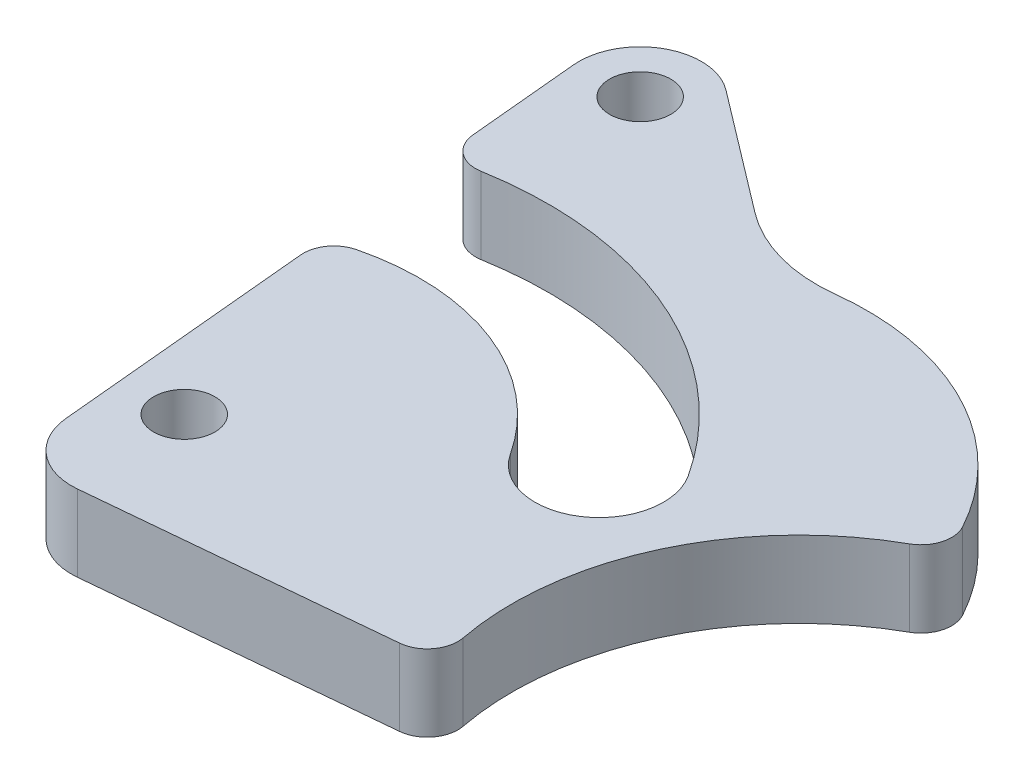
ISO-10303-21;
HEADER;
FILE_DESCRIPTION(('STEP AP214'),'2;1');
FILE_NAME('part.step','',(''),(''),'','','');
FILE_SCHEMA(('AUTOMOTIVE_DESIGN { 1 0 10303 214 1 1 1 1 }'));
ENDSEC;
DATA;
#1=APPLICATION_CONTEXT('core data for automotive mechanical design processes');
#2=APPLICATION_PROTOCOL_DEFINITION('international standard','automotive_design',2000,#1);
#3=PRODUCT_CONTEXT('',#1,'mechanical');
#4=PRODUCT('Part','Part','',(#3));
#5=PRODUCT_RELATED_PRODUCT_CATEGORY('part','',(#4));
#6=PRODUCT_DEFINITION_FORMATION('','',#4);
#7=PRODUCT_DEFINITION_CONTEXT('part definition',#1,'design');
#8=PRODUCT_DEFINITION('design','',#6,#7);
#9=PRODUCT_DEFINITION_SHAPE('','',#8);
#10=(LENGTH_UNIT() NAMED_UNIT(*) SI_UNIT(.MILLI.,.METRE.));
#11=(NAMED_UNIT(*) PLANE_ANGLE_UNIT() SI_UNIT($,.RADIAN.));
#12=(NAMED_UNIT(*) SI_UNIT($,.STERADIAN.) SOLID_ANGLE_UNIT());
#13=UNCERTAINTY_MEASURE_WITH_UNIT(LENGTH_MEASURE(1.E-05),#10,'distance_accuracy_value','');
#14=(GEOMETRIC_REPRESENTATION_CONTEXT(3) GLOBAL_UNCERTAINTY_ASSIGNED_CONTEXT((#13)) GLOBAL_UNIT_ASSIGNED_CONTEXT((#10,
#11,#12)) REPRESENTATION_CONTEXT('',''));
#15=CARTESIAN_POINT('',(0.,0.,0.));
#16=DIRECTION('',(0.,0.,1.));
#17=DIRECTION('',(1.,0.,0.));
#18=AXIS2_PLACEMENT_3D('',#15,#16,#17);
#19=CARTESIAN_POINT('',(9.77368523942251,5.,-12.861532423352));
#20=DIRECTION('',(0.605040910881647,0.,-0.796194383401131));
#21=DIRECTION('',(-0.796194383401131,0.,-0.605040910881647));
#22=AXIS2_PLACEMENT_3D('',#19,#20,#21);
#23=PLANE('',#22);
#24=DIRECTION('',(0.796194383401131,0.,0.605040910881647));
#25=VECTOR('',#24,1.);
#26=CARTESIAN_POINT('',(9.77368523942251,5.,-12.861532423352));
#27=LINE('',#26,#25);
#28=CARTESIAN_POINT('',(-20.7448000403564,5.,-36.0530199763391));
#29=VERTEX_POINT('',#28);
#30=CARTESIAN_POINT('',(-12.8371272271335,5.,-30.0438522886339));
#31=VERTEX_POINT('',#30);
#32=EDGE_CURVE('E204',#29,#31,#27,.T.);
#33=ORIENTED_EDGE('',*,*,#32,.T.);
#34=DIRECTION('',(0.,-1.,0.));
#35=VECTOR('',#34,1.);
#36=CARTESIAN_POINT('',(-12.8371272271335,0.,-30.0438522886339));
#37=LINE('',#36,#35);
#38=CARTESIAN_POINT('',(-12.8371272271335,0.,-30.0438522886339));
#39=VERTEX_POINT('',#38);
#40=EDGE_CURVE('E242',#31,#39,#37,.T.);
#41=ORIENTED_EDGE('',*,*,#40,.T.);
#42=DIRECTION('',(0.796194383401131,0.,0.605040910881647));
#43=VECTOR('',#42,1.);
#44=CARTESIAN_POINT('',(9.77368523942251,0.,-12.861532423352));
#45=LINE('',#44,#43);
#46=CARTESIAN_POINT('',(-20.7448000403564,0.,-36.0530199763391));
#47=VERTEX_POINT('',#46);
#48=EDGE_CURVE('E201',#47,#39,#45,.T.);
#49=ORIENTED_EDGE('',*,*,#48,.F.);
#50=DIRECTION('',(0.,-1.,0.));
#51=VECTOR('',#50,1.);
#52=CARTESIAN_POINT('',(-20.7448000403564,5.,-36.0530199763391));
#53=LINE('',#52,#51);
#54=EDGE_CURVE('E237',#29,#47,#53,.T.);
#55=ORIENTED_EDGE('',*,*,#54,.F.);
#56=EDGE_LOOP('',(#33,#41,#49,#55));
#57=FACE_BOUND('',#56,.T.);
#58=ADVANCED_FACE('F36',(#57),#23,.T.);
#59=CARTESIAN_POINT('',(-23.8955117873169,5.,2.23734414340496));
#60=DIRECTION('',(-0.995645293915383,0.,0.0932225761505825));
#61=DIRECTION('',(0.0932225761505825,0.,0.995645293915383));
#62=AXIS2_PLACEMENT_3D('',#59,#60,#61);
#63=PLANE('',#62);
#64=DIRECTION('',(-0.0932225761505825,0.,-0.995645293915383));
#65=VECTOR('',#64,1.);
#66=CARTESIAN_POINT('',(-23.8955117873169,5.,2.23734414340496));
#67=LINE('',#66,#65);
#68=CARTESIAN_POINT('',(-23.7209626279776,5.,4.10158193031544));
#69=VERTEX_POINT('',#68);
#70=CARTESIAN_POINT('',(-25.3052715150428,5.,-12.8193159106408));
#71=VERTEX_POINT('',#70);
#72=EDGE_CURVE('E212',#69,#71,#67,.T.);
#73=ORIENTED_EDGE('',*,*,#72,.T.);
#74=DIRECTION('',(0.,1.,0.));
#75=VECTOR('',#74,1.);
#76=CARTESIAN_POINT('',(-25.3052715150428,5.,-12.8193159106408));
#77=LINE('',#76,#75);
#78=CARTESIAN_POINT('',(-25.3052715150428,0.,-12.8193159106408));
#79=VERTEX_POINT('',#78);
#80=EDGE_CURVE('E249',#71,#79,#77,.F.);
#81=ORIENTED_EDGE('',*,*,#80,.T.);
#82=DIRECTION('',(-0.0932225761505825,0.,-0.995645293915383));
#83=VECTOR('',#82,1.);
#84=CARTESIAN_POINT('',(-23.8955117873169,0.,2.23734414340496));
#85=LINE('',#84,#83);
#86=CARTESIAN_POINT('',(-23.7209626279776,0.,4.10158193031544));
#87=VERTEX_POINT('',#86);
#88=EDGE_CURVE('E228',#87,#79,#85,.T.);
#89=ORIENTED_EDGE('',*,*,#88,.F.);
#90=DIRECTION('',(0.,1.,0.));
#91=VECTOR('',#90,1.);
#92=CARTESIAN_POINT('',(-23.7209626279776,0.,4.10158193031544));
#93=LINE('',#92,#91);
#94=EDGE_CURVE('E194',#87,#69,#93,.T.);
#95=ORIENTED_EDGE('',*,*,#94,.T.);
#96=EDGE_LOOP('',(#73,#81,#89,#95));
#97=FACE_BOUND('',#96,.T.);
#98=ADVANCED_FACE('F309',(#97),#63,.T.);
#99=CARTESIAN_POINT('',(0.,5.,0.));
#100=DIRECTION('',(0.,1.,0.));
#101=DIRECTION('',(0.,0.,1.));
#102=AXIS2_PLACEMENT_3D('',#99,#100,#101);
#103=PLANE('',#102);
#104=CARTESIAN_POINT('',(20.0875,5.,0.));
#105=DIRECTION('',(0.,1.,0.));
#106=DIRECTION('',(0.,0.,1.));
#107=AXIS2_PLACEMENT_3D('',#104,#105,#106);
#108=CIRCLE('',#107,18.75);
#109=CARTESIAN_POINT('',(10.9288284370782,5.,-16.3609668174753));
#110=VERTEX_POINT('',#109);
#111=CARTESIAN_POINT('',(1.67452451258119,5.,3.53904417883053));
#112=VERTEX_POINT('',#111);
#113=EDGE_CURVE('E287',#110,#112,#108,.T.);
#114=ORIENTED_EDGE('',*,*,#113,.F.);
#115=CARTESIAN_POINT('',(9.95190347036657,5.,-18.1061366113394));
#116=DIRECTION('',(0.,1.,0.));
#117=DIRECTION('',(0.,0.,1.));
#118=AXIS2_PLACEMENT_3D('',#115,#116,#117);
#119=CIRCLE('',#118,2.);
#120=CARTESIAN_POINT('',(11.7077420254744,5.,-19.063753950571));
#121=VERTEX_POINT('',#120);
#122=EDGE_CURVE('E274',#110,#121,#119,.T.);
#123=ORIENTED_EDGE('',*,*,#122,.T.);
#124=CARTESIAN_POINT('',(-3.65584533171876,5.,-10.6846022322945));
#125=DIRECTION('',(0.,1.,0.));
#126=DIRECTION('',(0.,0.,1.));
#127=AXIS2_PLACEMENT_3D('',#124,#125,#126);
#128=CIRCLE('',#127,17.5);
#129=CARTESIAN_POINT('',(-5.64821892319036,5.,-28.070816526154));
#130=VERTEX_POINT('',#129);
#131=EDGE_CURVE('E179',#121,#130,#128,.T.);
#132=ORIENTED_EDGE('',*,*,#131,.T.);
#133=CARTESIAN_POINT('',(-6.78671811831698,5.,-38.0057961226452));
#134=DIRECTION('',(0.,1.,0.));
#135=DIRECTION('',(0.,0.,1.));
#136=AXIS2_PLACEMENT_3D('',#133,#134,#135);
#137=CIRCLE('',#136,10.);
#138=EDGE_CURVE('E244',#130,#31,#137,.F.);
#139=ORIENTED_EDGE('',*,*,#138,.T.);
#140=ORIENTED_EDGE('',*,*,#32,.F.);
#141=CARTESIAN_POINT('',(-23.164963683883,5.,-32.8682424427346));
#142=DIRECTION('',(0.,1.,0.));
#143=DIRECTION('',(0.,0.,1.));
#144=AXIS2_PLACEMENT_3D('',#141,#142,#143);
#145=CIRCLE('',#144,4.);
#146=CARTESIAN_POINT('',(-27.1475448595446,5.,-32.4953521381323));
#147=VERTEX_POINT('',#146);
#148=EDGE_CURVE('E207',#29,#147,#145,.T.);
#149=ORIENTED_EDGE('',*,*,#148,.T.);
#150=CARTESIAN_POINT('',(-26.4679861947594,5.,-25.2374601717068));
#151=VERTEX_POINT('',#150);
#152=EDGE_CURVE('E211',#151,#147,#67,.T.);
#153=ORIENTED_EDGE('',*,*,#152,.F.);
#154=CARTESIAN_POINT('',(-24.4766956069286,5.,-25.4239053240079));
#155=DIRECTION('',(0.,1.,0.));
#156=DIRECTION('',(0.,0.,1.));
#157=AXIS2_PLACEMENT_3D('',#154,#155,#156);
#158=CIRCLE('',#157,2.);
#159=CARTESIAN_POINT('',(-24.1364478854613,5.,-23.4530599500538));
#160=VERTEX_POINT('',#159);
#161=EDGE_CURVE('E257',#151,#160,#158,.T.);
#162=ORIENTED_EDGE('',*,*,#161,.T.);
#163=CARTESIAN_POINT('',(-20.0875,5.,0.));
#164=DIRECTION('',(0.,1.,0.));
#165=DIRECTION('',(0.,0.,1.));
#166=AXIS2_PLACEMENT_3D('',#163,#164,#165);
#167=CIRCLE('',#166,23.8);
#168=CARTESIAN_POINT('',(-0.134776474229926,5.,-12.9741598535004));
#169=VERTEX_POINT('',#168);
#170=EDGE_CURVE('E173',#169,#160,#167,.T.);
#171=ORIENTED_EDGE('',*,*,#170,.F.);
#172=CARTESIAN_POINT('',(-3.65584533171876,5.,-10.6846022322945));
#173=DIRECTION('',(0.,1.,0.));
#174=DIRECTION('',(0.,0.,1.));
#175=AXIS2_PLACEMENT_3D('',#172,#173,#174);
#176=CIRCLE('',#175,4.2);
#177=CARTESIAN_POINT('',(-7.1769141892076,5.,-8.39504461108851));
#178=VERTEX_POINT('',#177);
#179=EDGE_CURVE('E176',#178,#169,#176,.T.);
#180=ORIENTED_EDGE('',*,*,#179,.F.);
#181=CARTESIAN_POINT('',(-20.0875,5.,0.));
#182=DIRECTION('',(0.,1.,0.));
#183=DIRECTION('',(0.,0.,1.));
#184=AXIS2_PLACEMENT_3D('',#181,#182,#183);
#185=CIRCLE('',#184,15.4);
#186=CARTESIAN_POINT('',(-23.7955452447063,5.,-14.9469194305452));
#187=VERTEX_POINT('',#186);
#188=EDGE_CURVE('E157',#178,#187,#185,.T.);
#189=ORIENTED_EDGE('',*,*,#188,.T.);
#190=CARTESIAN_POINT('',(-23.313980927212,5.,-13.005761062942));
#191=DIRECTION('',(0.,1.,0.));
#192=DIRECTION('',(0.,0.,1.));
#193=AXIS2_PLACEMENT_3D('',#190,#191,#192);
#194=CIRCLE('',#193,2.);
#195=EDGE_CURVE('E259',#187,#71,#194,.T.);
#196=ORIENTED_EDGE('',*,*,#195,.T.);
#197=ORIENTED_EDGE('',*,*,#72,.F.);
#198=CARTESIAN_POINT('',(-19.7383814523161,5.,3.7286916257131));
#199=DIRECTION('',(0.,1.,0.));
#200=DIRECTION('',(0.,0.,1.));
#201=AXIS2_PLACEMENT_3D('',#198,#199,#200);
#202=CIRCLE('',#201,4.);
#203=CARTESIAN_POINT('',(-19.3655127528816,5.,7.71127482421405));
#204=VERTEX_POINT('',#203);
#205=EDGE_CURVE('E186',#69,#204,#202,.T.);
#206=ORIENTED_EDGE('',*,*,#205,.T.);
#207=DIRECTION('',(0.995645799625237,0.,-0.0932171748586161));
#208=VECTOR('',#207,1.);
#209=CARTESIAN_POINT('',(0.547417859354654,5.,5.84692995827176));
#210=LINE('',#209,#208);
#211=CARTESIAN_POINT('',(-0.103091856359578,5.,5.90783382382293));
#212=VERTEX_POINT('',#211);
#213=EDGE_CURVE('E192',#204,#212,#210,.T.);
#214=ORIENTED_EDGE('',*,*,#213,.T.);
#215=CARTESIAN_POINT('',(-0.28952620607681,5.,3.91654222457246));
#216=DIRECTION('',(0.,1.,0.));
#217=DIRECTION('',(0.,0.,1.));
#218=AXIS2_PLACEMENT_3D('',#215,#216,#217);
#219=CIRCLE('',#218,2.);
#220=EDGE_CURVE('E272',#212,#112,#219,.T.);
#221=ORIENTED_EDGE('',*,*,#220,.T.);
#222=EDGE_LOOP('',(#114,#123,#132,#139,#140,#149,#153,#162,#171,#180,#189,#196,#197,#206,#214,#221));
#223=FACE_BOUND('',#222,.T.);
#224=CARTESIAN_POINT('',(-20.0875,5.,0.));
#225=DIRECTION('',(0.,1.,0.));
#226=DIRECTION('',(0.,0.,1.));
#227=AXIS2_PLACEMENT_3D('',#224,#225,#226);
#228=CIRCLE('',#227,2.);
#229=CARTESIAN_POINT('',(-20.0875,5.,1.99999999999999));
#230=VERTEX_POINT('',#229);
#231=EDGE_CURVE('E215',#230,#230,#228,.T.);
#232=ORIENTED_EDGE('',*,*,#231,.F.);
#233=EDGE_LOOP('',(#232));
#234=FACE_BOUND('',#233,.T.);
#235=CARTESIAN_POINT('',(-23.164963683883,5.,-32.8682424427346));
#236=DIRECTION('',(0.,1.,0.));
#237=DIRECTION('',(0.,0.,1.));
#238=AXIS2_PLACEMENT_3D('',#235,#236,#237);
#239=CIRCLE('',#238,2.);
#240=CARTESIAN_POINT('',(-23.164963683883,5.,-30.8682424427346));
#241=VERTEX_POINT('',#240);
#242=EDGE_CURVE('E218',#241,#241,#239,.T.);
#243=ORIENTED_EDGE('',*,*,#242,.F.);
#244=EDGE_LOOP('',(#243));
#245=FACE_BOUND('',#244,.T.);
#246=ADVANCED_FACE('F291',(#223,#234,#245),#103,.T.);
#247=CARTESIAN_POINT('',(0.,0.,0.));
#248=DIRECTION('',(0.,1.,0.));
#249=DIRECTION('',(0.,0.,1.));
#250=AXIS2_PLACEMENT_3D('',#247,#248,#249);
#251=PLANE('',#250);
#252=CARTESIAN_POINT('',(-23.164963683883,0.,-32.8682424427346));
#253=DIRECTION('',(0.,1.,0.));
#254=DIRECTION('',(0.,0.,1.));
#255=AXIS2_PLACEMENT_3D('',#252,#253,#254);
#256=CIRCLE('',#255,2.);
#257=CARTESIAN_POINT('',(-23.164963683883,0.,-30.8682424427346));
#258=VERTEX_POINT('',#257);
#259=EDGE_CURVE('E208',#258,#258,#256,.T.);
#260=ORIENTED_EDGE('',*,*,#259,.T.);
#261=EDGE_LOOP('',(#260));
#262=FACE_BOUND('',#261,.T.);
#263=CARTESIAN_POINT('',(-20.0875,0.,0.));
#264=DIRECTION('',(0.,1.,0.));
#265=DIRECTION('',(0.,0.,1.));
#266=AXIS2_PLACEMENT_3D('',#263,#264,#265);
#267=CIRCLE('',#266,2.);
#268=CARTESIAN_POINT('',(-20.0875,0.,1.99999999999999));
#269=VERTEX_POINT('',#268);
#270=EDGE_CURVE('E230',#269,#269,#267,.T.);
#271=ORIENTED_EDGE('',*,*,#270,.T.);
#272=EDGE_LOOP('',(#271));
#273=FACE_BOUND('',#272,.T.);
#274=CARTESIAN_POINT('',(-3.65584533171876,0.,-10.6846022322945));
#275=DIRECTION('',(0.,1.,0.));
#276=DIRECTION('',(0.,0.,1.));
#277=AXIS2_PLACEMENT_3D('',#274,#275,#276);
#278=CIRCLE('',#277,17.5);
#279=CARTESIAN_POINT('',(11.7077420254744,0.,-19.063753950571));
#280=VERTEX_POINT('',#279);
#281=CARTESIAN_POINT('',(-5.64821892319036,0.,-28.070816526154));
#282=VERTEX_POINT('',#281);
#283=EDGE_CURVE('E184',#280,#282,#278,.T.);
#284=ORIENTED_EDGE('',*,*,#283,.F.);
#285=CARTESIAN_POINT('',(9.95190347036657,0.,-18.1061366113394));
#286=DIRECTION('',(0.,1.,0.));
#287=DIRECTION('',(0.,0.,1.));
#288=AXIS2_PLACEMENT_3D('',#285,#286,#287);
#289=CIRCLE('',#288,2.);
#290=CARTESIAN_POINT('',(10.9288284370782,0.,-16.3609668174753));
#291=VERTEX_POINT('',#290);
#292=EDGE_CURVE('E44',#280,#291,#289,.F.);
#293=ORIENTED_EDGE('',*,*,#292,.T.);
#294=CARTESIAN_POINT('',(20.0875,0.,0.));
#295=DIRECTION('',(0.,1.,0.));
#296=DIRECTION('',(0.,0.,1.));
#297=AXIS2_PLACEMENT_3D('',#294,#295,#296);
#298=CIRCLE('',#297,18.75);
#299=CARTESIAN_POINT('',(1.67452451258119,0.,3.53904417883053));
#300=VERTEX_POINT('',#299);
#301=EDGE_CURVE('E279',#291,#300,#298,.T.);
#302=ORIENTED_EDGE('',*,*,#301,.T.);
#303=CARTESIAN_POINT('',(-0.28952620607681,0.,3.91654222457246));
#304=DIRECTION('',(0.,1.,0.));
#305=DIRECTION('',(0.,0.,1.));
#306=AXIS2_PLACEMENT_3D('',#303,#304,#305);
#307=CIRCLE('',#306,2.);
#308=CARTESIAN_POINT('',(-0.103091856359578,0.,5.90783382382293));
#309=VERTEX_POINT('',#308);
#310=EDGE_CURVE('E51',#300,#309,#307,.F.);
#311=ORIENTED_EDGE('',*,*,#310,.T.);
#312=DIRECTION('',(0.995645799625237,0.,-0.0932171748586161));
#313=VECTOR('',#312,1.);
#314=CARTESIAN_POINT('',(0.547417859354654,0.,5.84692995827176));
#315=LINE('',#314,#313);
#316=CARTESIAN_POINT('',(-19.3655127528816,0.,7.71127482421405));
#317=VERTEX_POINT('',#316);
#318=EDGE_CURVE('E191',#317,#309,#315,.T.);
#319=ORIENTED_EDGE('',*,*,#318,.F.);
#320=CARTESIAN_POINT('',(-19.7383814523161,0.,3.7286916257131));
#321=DIRECTION('',(0.,1.,0.));
#322=DIRECTION('',(0.,0.,1.));
#323=AXIS2_PLACEMENT_3D('',#320,#321,#322);
#324=CIRCLE('',#323,4.);
#325=EDGE_CURVE('E188',#87,#317,#324,.T.);
#326=ORIENTED_EDGE('',*,*,#325,.F.);
#327=ORIENTED_EDGE('',*,*,#88,.T.);
#328=CARTESIAN_POINT('',(-23.313980927212,0.,-13.005761062942));
#329=DIRECTION('',(0.,1.,0.));
#330=DIRECTION('',(0.,0.,1.));
#331=AXIS2_PLACEMENT_3D('',#328,#329,#330);
#332=CIRCLE('',#331,2.);
#333=CARTESIAN_POINT('',(-23.7955452447063,0.,-14.9469194305452));
#334=VERTEX_POINT('',#333);
#335=EDGE_CURVE('E172',#79,#334,#332,.F.);
#336=ORIENTED_EDGE('',*,*,#335,.T.);
#337=CARTESIAN_POINT('',(-20.0875,0.,0.));
#338=DIRECTION('',(0.,1.,0.));
#339=DIRECTION('',(0.,0.,1.));
#340=AXIS2_PLACEMENT_3D('',#337,#338,#339);
#341=CIRCLE('',#340,15.4);
#342=CARTESIAN_POINT('',(-7.1769141892076,0.,-8.39504461108851));
#343=VERTEX_POINT('',#342);
#344=EDGE_CURVE('E154',#343,#334,#341,.T.);
#345=ORIENTED_EDGE('',*,*,#344,.F.);
#346=CARTESIAN_POINT('',(-3.65584533171876,0.,-10.6846022322945));
#347=DIRECTION('',(0.,1.,0.));
#348=DIRECTION('',(0.,0.,1.));
#349=AXIS2_PLACEMENT_3D('',#346,#347,#348);
#350=CIRCLE('',#349,4.2);
#351=CARTESIAN_POINT('',(-0.134776474229925,0.,-12.9741598535004));
#352=VERTEX_POINT('',#351);
#353=EDGE_CURVE('E166',#343,#352,#350,.T.);
#354=ORIENTED_EDGE('',*,*,#353,.T.);
#355=CARTESIAN_POINT('',(-20.0875,0.,0.));
#356=DIRECTION('',(0.,1.,0.));
#357=DIRECTION('',(0.,0.,1.));
#358=AXIS2_PLACEMENT_3D('',#355,#356,#357);
#359=CIRCLE('',#358,23.8);
#360=CARTESIAN_POINT('',(-24.1364478854613,0.,-23.4530599500538));
#361=VERTEX_POINT('',#360);
#362=EDGE_CURVE('E162',#352,#361,#359,.T.);
#363=ORIENTED_EDGE('',*,*,#362,.T.);
#364=CARTESIAN_POINT('',(-24.4766956069286,0.,-25.4239053240079));
#365=DIRECTION('',(0.,1.,0.));
#366=DIRECTION('',(0.,0.,1.));
#367=AXIS2_PLACEMENT_3D('',#364,#365,#366);
#368=CIRCLE('',#367,2.);
#369=CARTESIAN_POINT('',(-26.4679861947594,0.,-25.2374601717068));
#370=VERTEX_POINT('',#369);
#371=EDGE_CURVE('E252',#361,#370,#368,.F.);
#372=ORIENTED_EDGE('',*,*,#371,.T.);
#373=CARTESIAN_POINT('',(-27.1475448595446,0.,-32.4953521381323));
#374=VERTEX_POINT('',#373);
#375=EDGE_CURVE('E227',#370,#374,#85,.T.);
#376=ORIENTED_EDGE('',*,*,#375,.T.);
#377=CARTESIAN_POINT('',(-23.164963683883,0.,-32.8682424427346));
#378=DIRECTION('',(0.,1.,0.));
#379=DIRECTION('',(0.,0.,1.));
#380=AXIS2_PLACEMENT_3D('',#377,#378,#379);
#381=CIRCLE('',#380,4.);
#382=EDGE_CURVE('E224',#47,#374,#381,.T.);
#383=ORIENTED_EDGE('',*,*,#382,.F.);
#384=ORIENTED_EDGE('',*,*,#48,.T.);
#385=CARTESIAN_POINT('',(-6.78671811831698,0.,-38.0057961226452));
#386=DIRECTION('',(0.,1.,0.));
#387=DIRECTION('',(0.,0.,1.));
#388=AXIS2_PLACEMENT_3D('',#385,#386,#387);
#389=CIRCLE('',#388,10.);
#390=EDGE_CURVE('E246',#39,#282,#389,.T.);
#391=ORIENTED_EDGE('',*,*,#390,.T.);
#392=EDGE_LOOP('',(#284,#293,#302,#311,#319,#326,#327,#336,#345,#354,#363,#372,#376,#383,#384,#391));
#393=FACE_BOUND('',#392,.T.);
#394=ADVANCED_FACE('F170',(#262,#273,#393),#251,.F.);
#395=CARTESIAN_POINT('',(-23.164963683883,5.,-32.8682424427346));
#396=DIRECTION('',(0.,-1.,0.));
#397=DIRECTION('',(0.,0.,-1.));
#398=AXIS2_PLACEMENT_3D('',#395,#396,#397);
#399=CYLINDRICAL_SURFACE('',#398,4.);
#400=ORIENTED_EDGE('',*,*,#382,.T.);
#401=DIRECTION('',(0.,-1.,0.));
#402=VECTOR('',#401,1.);
#403=CARTESIAN_POINT('',(-27.1475448595446,5.,-32.4953521381323));
#404=LINE('',#403,#402);
#405=EDGE_CURVE('E221',#147,#374,#404,.T.);
#406=ORIENTED_EDGE('',*,*,#405,.F.);
#407=ORIENTED_EDGE('',*,*,#148,.F.);
#408=ORIENTED_EDGE('',*,*,#54,.T.);
#409=EDGE_LOOP('',(#400,#406,#407,#408));
#410=FACE_BOUND('',#409,.T.);
#411=ADVANCED_FACE('F330',(#410),#399,.T.);
#412=ORIENTED_EDGE('',*,*,#375,.F.);
#413=DIRECTION('',(0.,-1.,0.));
#414=VECTOR('',#413,1.);
#415=CARTESIAN_POINT('',(-26.4679861947594,5.,-25.2374601717068));
#416=LINE('',#415,#414);
#417=EDGE_CURVE('E264',#370,#151,#416,.F.);
#418=ORIENTED_EDGE('',*,*,#417,.T.);
#419=ORIENTED_EDGE('',*,*,#152,.T.);
#420=ORIENTED_EDGE('',*,*,#405,.T.);
#421=EDGE_LOOP('',(#412,#418,#419,#420));
#422=FACE_BOUND('',#421,.T.);
#423=ADVANCED_FACE('F326',(#422),#63,.T.);
#424=CARTESIAN_POINT('',(-20.0875,5.,0.));
#425=DIRECTION('',(0.,-1.,0.));
#426=DIRECTION('',(0.,0.,-1.));
#427=AXIS2_PLACEMENT_3D('',#424,#425,#426);
#428=CYLINDRICAL_SURFACE('',#427,2.);
#429=ORIENTED_EDGE('',*,*,#231,.T.);
#430=EDGE_LOOP('',(#429));
#431=FACE_BOUND('',#430,.T.);
#432=ORIENTED_EDGE('',*,*,#270,.F.);
#433=EDGE_LOOP('',(#432));
#434=FACE_BOUND('',#433,.T.);
#435=ADVANCED_FACE('F356',(#431,#434),#428,.F.);
#436=CARTESIAN_POINT('',(-23.164963683883,5.,-32.8682424427346));
#437=DIRECTION('',(0.,-1.,0.));
#438=DIRECTION('',(0.,0.,-1.));
#439=AXIS2_PLACEMENT_3D('',#436,#437,#438);
#440=CYLINDRICAL_SURFACE('',#439,2.);
#441=ORIENTED_EDGE('',*,*,#242,.T.);
#442=EDGE_LOOP('',(#441));
#443=FACE_BOUND('',#442,.T.);
#444=ORIENTED_EDGE('',*,*,#259,.F.);
#445=EDGE_LOOP('',(#444));
#446=FACE_BOUND('',#445,.T.);
#447=ADVANCED_FACE('F359',(#443,#446),#440,.F.);
#448=CARTESIAN_POINT('',(0.547417859354654,0.,5.84692995827176));
#449=DIRECTION('',(0.0932171748586161,0.,0.995645799625237));
#450=DIRECTION('',(0.995645799625237,0.,-0.0932171748586161));
#451=AXIS2_PLACEMENT_3D('',#448,#449,#450);
#452=PLANE('',#451);
#453=ORIENTED_EDGE('',*,*,#318,.T.);
#454=DIRECTION('',(0.,-1.,0.));
#455=VECTOR('',#454,1.);
#456=CARTESIAN_POINT('',(-0.103091856359578,5.,5.90783382382293));
#457=LINE('',#456,#455);
#458=EDGE_CURVE('E11',#309,#212,#457,.F.);
#459=ORIENTED_EDGE('',*,*,#458,.T.);
#460=ORIENTED_EDGE('',*,*,#213,.F.);
#461=DIRECTION('',(0.,1.,0.));
#462=VECTOR('',#461,1.);
#463=CARTESIAN_POINT('',(-19.3655127528816,0.,7.71127482421405));
#464=LINE('',#463,#462);
#465=EDGE_CURVE('E199',#317,#204,#464,.T.);
#466=ORIENTED_EDGE('',*,*,#465,.F.);
#467=EDGE_LOOP('',(#453,#459,#460,#466));
#468=FACE_BOUND('',#467,.T.);
#469=ADVANCED_FACE('F302',(#468),#452,.T.);
#470=CARTESIAN_POINT('',(-19.7383814523161,0.,3.7286916257131));
#471=DIRECTION('',(0.,1.,0.));
#472=DIRECTION('',(0.,0.,1.));
#473=AXIS2_PLACEMENT_3D('',#470,#471,#472);
#474=CYLINDRICAL_SURFACE('',#473,4.);
#475=ORIENTED_EDGE('',*,*,#205,.F.);
#476=ORIENTED_EDGE('',*,*,#94,.F.);
#477=ORIENTED_EDGE('',*,*,#325,.T.);
#478=ORIENTED_EDGE('',*,*,#465,.T.);
#479=EDGE_LOOP('',(#475,#476,#477,#478));
#480=FACE_BOUND('',#479,.T.);
#481=ADVANCED_FACE('F306',(#480),#474,.T.);
#482=CARTESIAN_POINT('',(-20.0875,0.,0.));
#483=DIRECTION('',(0.,1.,0.));
#484=DIRECTION('',(0.,0.,1.));
#485=AXIS2_PLACEMENT_3D('',#482,#483,#484);
#486=CYLINDRICAL_SURFACE('',#485,15.4);
#487=ORIENTED_EDGE('',*,*,#344,.T.);
#488=DIRECTION('',(0.,1.,0.));
#489=VECTOR('',#488,1.);
#490=CARTESIAN_POINT('',(-23.7955452447063,0.,-14.9469194305452));
#491=LINE('',#490,#489);
#492=EDGE_CURVE('E255',#334,#187,#491,.T.);
#493=ORIENTED_EDGE('',*,*,#492,.T.);
#494=ORIENTED_EDGE('',*,*,#188,.F.);
#495=DIRECTION('',(0.,1.,0.));
#496=VECTOR('',#495,1.);
#497=CARTESIAN_POINT('',(-7.1769141892076,0.,-8.39504461108851));
#498=LINE('',#497,#496);
#499=EDGE_CURVE('E150',#343,#178,#498,.T.);
#500=ORIENTED_EDGE('',*,*,#499,.F.);
#501=EDGE_LOOP('',(#487,#493,#494,#500));
#502=FACE_BOUND('',#501,.T.);
#503=ADVANCED_FACE('F152',(#502),#486,.T.);
#504=CARTESIAN_POINT('',(-20.0875,0.,0.));
#505=DIRECTION('',(0.,1.,0.));
#506=DIRECTION('',(0.,0.,1.));
#507=AXIS2_PLACEMENT_3D('',#504,#505,#506);
#508=CYLINDRICAL_SURFACE('',#507,23.8);
#509=ORIENTED_EDGE('',*,*,#170,.T.);
#510=DIRECTION('',(0.,1.,0.));
#511=VECTOR('',#510,1.);
#512=CARTESIAN_POINT('',(-24.1364478854613,0.,-23.4530599500538));
#513=LINE('',#512,#511);
#514=EDGE_CURVE('E261',#160,#361,#513,.F.);
#515=ORIENTED_EDGE('',*,*,#514,.T.);
#516=ORIENTED_EDGE('',*,*,#362,.F.);
#517=DIRECTION('',(0.,1.,0.));
#518=VECTOR('',#517,1.);
#519=CARTESIAN_POINT('',(-0.134776474229926,0.,-12.9741598535004));
#520=LINE('',#519,#518);
#521=EDGE_CURVE('E161',#352,#169,#520,.T.);
#522=ORIENTED_EDGE('',*,*,#521,.T.);
#523=EDGE_LOOP('',(#509,#515,#516,#522));
#524=FACE_BOUND('',#523,.T.);
#525=ADVANCED_FACE('F319',(#524),#508,.F.);
#526=CARTESIAN_POINT('',(-3.65584533171876,0.,-10.6846022322945));
#527=DIRECTION('',(0.,1.,0.));
#528=DIRECTION('',(0.,0.,1.));
#529=AXIS2_PLACEMENT_3D('',#526,#527,#528);
#530=CYLINDRICAL_SURFACE('',#529,4.2);
#531=ORIENTED_EDGE('',*,*,#179,.T.);
#532=ORIENTED_EDGE('',*,*,#521,.F.);
#533=ORIENTED_EDGE('',*,*,#353,.F.);
#534=ORIENTED_EDGE('',*,*,#499,.T.);
#535=EDGE_LOOP('',(#531,#532,#533,#534));
#536=FACE_BOUND('',#535,.T.);
#537=ADVANCED_FACE('F167',(#536),#530,.F.);
#538=CARTESIAN_POINT('',(-3.65584533171876,0.,-10.6846022322945));
#539=DIRECTION('',(0.,1.,0.));
#540=DIRECTION('',(0.,0.,1.));
#541=AXIS2_PLACEMENT_3D('',#538,#539,#540);
#542=CYLINDRICAL_SURFACE('',#541,17.5);
#543=ORIENTED_EDGE('',*,*,#131,.F.);
#544=DIRECTION('',(0.,1.,0.));
#545=VECTOR('',#544,1.);
#546=CARTESIAN_POINT('',(11.7077420254744,0.,-19.063753950571));
#547=LINE('',#546,#545);
#548=EDGE_CURVE('E59',#121,#280,#547,.F.);
#549=ORIENTED_EDGE('',*,*,#548,.T.);
#550=ORIENTED_EDGE('',*,*,#283,.T.);
#551=DIRECTION('',(0.,1.,0.));
#552=VECTOR('',#551,1.);
#553=CARTESIAN_POINT('',(-5.64821892319036,0.,-28.070816526154));
#554=LINE('',#553,#552);
#555=EDGE_CURVE('E239',#282,#130,#554,.T.);
#556=ORIENTED_EDGE('',*,*,#555,.T.);
#557=EDGE_LOOP('',(#543,#549,#550,#556));
#558=FACE_BOUND('',#557,.T.);
#559=ADVANCED_FACE('F294',(#558),#542,.T.);
#560=CARTESIAN_POINT('',(-6.78671811831698,0.,-38.0057961226452));
#561=DIRECTION('',(0.,1.,0.));
#562=DIRECTION('',(0.,0.,1.));
#563=AXIS2_PLACEMENT_3D('',#560,#561,#562);
#564=CYLINDRICAL_SURFACE('',#563,10.);
#565=ORIENTED_EDGE('',*,*,#390,.F.);
#566=ORIENTED_EDGE('',*,*,#40,.F.);
#567=ORIENTED_EDGE('',*,*,#138,.F.);
#568=ORIENTED_EDGE('',*,*,#555,.F.);
#569=EDGE_LOOP('',(#565,#566,#567,#568));
#570=FACE_BOUND('',#569,.T.);
#571=ADVANCED_FACE('F337',(#570),#564,.F.);
#572=CARTESIAN_POINT('',(-23.313980927212,0.,-13.005761062942));
#573=DIRECTION('',(0.,1.,0.));
#574=DIRECTION('',(0.,0.,1.));
#575=AXIS2_PLACEMENT_3D('',#572,#573,#574);
#576=CYLINDRICAL_SURFACE('',#575,2.);
#577=ORIENTED_EDGE('',*,*,#195,.F.);
#578=ORIENTED_EDGE('',*,*,#492,.F.);
#579=ORIENTED_EDGE('',*,*,#335,.F.);
#580=ORIENTED_EDGE('',*,*,#80,.F.);
#581=EDGE_LOOP('',(#577,#578,#579,#580));
#582=FACE_BOUND('',#581,.T.);
#583=ADVANCED_FACE('F313',(#582),#576,.T.);
#584=CARTESIAN_POINT('',(-24.4766956069286,0.,-25.4239053240079));
#585=DIRECTION('',(0.,1.,0.));
#586=DIRECTION('',(0.,0.,1.));
#587=AXIS2_PLACEMENT_3D('',#584,#585,#586);
#588=CYLINDRICAL_SURFACE('',#587,2.);
#589=ORIENTED_EDGE('',*,*,#161,.F.);
#590=ORIENTED_EDGE('',*,*,#417,.F.);
#591=ORIENTED_EDGE('',*,*,#371,.F.);
#592=ORIENTED_EDGE('',*,*,#514,.F.);
#593=EDGE_LOOP('',(#589,#590,#591,#592));
#594=FACE_BOUND('',#593,.T.);
#595=ADVANCED_FACE('F321',(#594),#588,.T.);
#596=CARTESIAN_POINT('',(20.0875,0.,0.));
#597=DIRECTION('',(0.,1.,0.));
#598=DIRECTION('',(0.,0.,1.));
#599=AXIS2_PLACEMENT_3D('',#596,#597,#598);
#600=CYLINDRICAL_SURFACE('',#599,18.75);
#601=ORIENTED_EDGE('',*,*,#301,.F.);
#602=DIRECTION('',(0.,1.,0.));
#603=VECTOR('',#602,1.);
#604=CARTESIAN_POINT('',(10.9288284370782,0.,-16.3609668174753));
#605=LINE('',#604,#603);
#606=EDGE_CURVE('E269',#291,#110,#605,.T.);
#607=ORIENTED_EDGE('',*,*,#606,.T.);
#608=ORIENTED_EDGE('',*,*,#113,.T.);
#609=DIRECTION('',(0.,1.,0.));
#610=VECTOR('',#609,1.);
#611=CARTESIAN_POINT('',(1.67452451258119,0.,3.53904417883053));
#612=LINE('',#611,#610);
#613=EDGE_CURVE('E266',#112,#300,#612,.F.);
#614=ORIENTED_EDGE('',*,*,#613,.T.);
#615=EDGE_LOOP('',(#601,#607,#608,#614));
#616=FACE_BOUND('',#615,.T.);
#617=ADVANCED_FACE('F283',(#616),#600,.F.);
#618=CARTESIAN_POINT('',(9.95190347036657,0.,-18.1061366113394));
#619=DIRECTION('',(0.,-1.,0.));
#620=DIRECTION('',(0.,0.,-1.));
#621=AXIS2_PLACEMENT_3D('',#618,#619,#620);
#622=CYLINDRICAL_SURFACE('',#621,2.);
#623=ORIENTED_EDGE('',*,*,#292,.F.);
#624=ORIENTED_EDGE('',*,*,#548,.F.);
#625=ORIENTED_EDGE('',*,*,#122,.F.);
#626=ORIENTED_EDGE('',*,*,#606,.F.);
#627=EDGE_LOOP('',(#623,#624,#625,#626));
#628=FACE_BOUND('',#627,.T.);
#629=ADVANCED_FACE('F289',(#628),#622,.T.);
#630=CARTESIAN_POINT('',(-0.28952620607681,0.,3.91654222457246));
#631=DIRECTION('',(0.,1.,0.));
#632=DIRECTION('',(0.,0.,1.));
#633=AXIS2_PLACEMENT_3D('',#630,#631,#632);
#634=CYLINDRICAL_SURFACE('',#633,2.);
#635=ORIENTED_EDGE('',*,*,#220,.F.);
#636=ORIENTED_EDGE('',*,*,#458,.F.);
#637=ORIENTED_EDGE('',*,*,#310,.F.);
#638=ORIENTED_EDGE('',*,*,#613,.F.);
#639=EDGE_LOOP('',(#635,#636,#637,#638));
#640=FACE_BOUND('',#639,.T.);
#641=ADVANCED_FACE('F38',(#640),#634,.T.);
#642=CLOSED_SHELL('',(#58,#98,#246,#394,#411,#423,#435,#447,#469,#481,#503,#525,#537,#559,#571,
#583,#595,#617,#629,#641));
#643=MANIFOLD_SOLID_BREP('B2',#642);
#644=ADVANCED_BREP_SHAPE_REPRESENTATION('',(#18,#643),#14);
#645=SHAPE_DEFINITION_REPRESENTATION(#9,#644);
ENDSEC;
END-ISO-10303-21;
